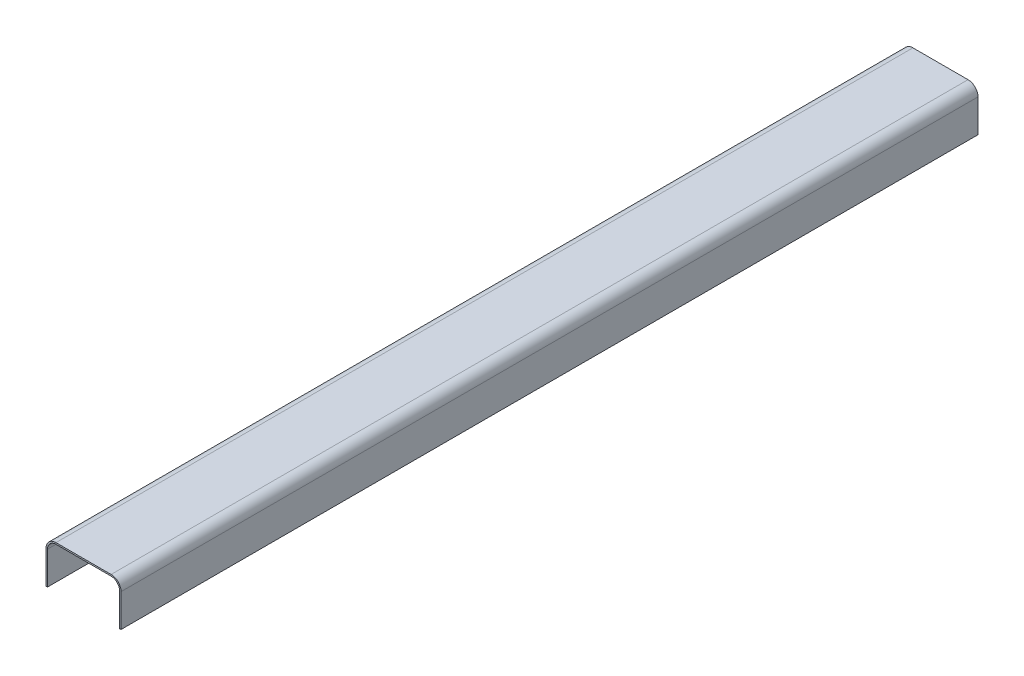
ISO-10303-21;
HEADER;
FILE_DESCRIPTION(('STEP AP214'),'2;1');
FILE_NAME('part.step','',(''),(''),'','','');
FILE_SCHEMA(('AUTOMOTIVE_DESIGN { 1 0 10303 214 1 1 1 1 }'));
ENDSEC;
DATA;
#1=APPLICATION_CONTEXT('core data for automotive mechanical design processes');
#2=APPLICATION_PROTOCOL_DEFINITION('international standard','automotive_design',2000,#1);
#3=PRODUCT_CONTEXT('',#1,'mechanical');
#4=PRODUCT('Part','Part','',(#3));
#5=PRODUCT_RELATED_PRODUCT_CATEGORY('part','',(#4));
#6=PRODUCT_DEFINITION_FORMATION('','',#4);
#7=PRODUCT_DEFINITION_CONTEXT('part definition',#1,'design');
#8=PRODUCT_DEFINITION('design','',#6,#7);
#9=PRODUCT_DEFINITION_SHAPE('','',#8);
#10=(LENGTH_UNIT() NAMED_UNIT(*) SI_UNIT(.MILLI.,.METRE.));
#11=(NAMED_UNIT(*) PLANE_ANGLE_UNIT() SI_UNIT($,.RADIAN.));
#12=(NAMED_UNIT(*) SI_UNIT($,.STERADIAN.) SOLID_ANGLE_UNIT());
#13=UNCERTAINTY_MEASURE_WITH_UNIT(LENGTH_MEASURE(1.E-05),#10,'distance_accuracy_value','');
#14=(GEOMETRIC_REPRESENTATION_CONTEXT(3) GLOBAL_UNCERTAINTY_ASSIGNED_CONTEXT((#13)) GLOBAL_UNIT_ASSIGNED_CONTEXT((#10,
#11,#12)) REPRESENTATION_CONTEXT('',''));
#15=CARTESIAN_POINT('',(0.,0.,0.));
#16=DIRECTION('',(0.,0.,1.));
#17=DIRECTION('',(1.,0.,0.));
#18=AXIS2_PLACEMENT_3D('',#15,#16,#17);
#19=CARTESIAN_POINT('',(0.,0.,1724.45));
#20=DIRECTION('',(0.,1.,0.));
#21=DIRECTION('',(0.,0.,1.));
#22=AXIS2_PLACEMENT_3D('',#19,#20,#21);
#23=PLANE('',#22);
#24=DIRECTION('',(0.,0.,-1.));
#25=VECTOR('',#24,1.);
#26=CARTESIAN_POINT('',(3.,0.,1724.45));
#27=LINE('',#26,#25);
#28=CARTESIAN_POINT('',(3.,0.,1724.45));
#29=VERTEX_POINT('',#28);
#30=CARTESIAN_POINT('',(3.,0.,0.));
#31=VERTEX_POINT('',#30);
#32=EDGE_CURVE('E127',#29,#31,#27,.T.);
#33=ORIENTED_EDGE('',*,*,#32,.F.);
#34=DIRECTION('',(1.,0.,0.));
#35=VECTOR('',#34,1.);
#36=CARTESIAN_POINT('',(0.,0.,1724.45));
#37=LINE('',#36,#35);
#38=CARTESIAN_POINT('',(0.,0.,1724.45));
#39=VERTEX_POINT('',#38);
#40=EDGE_CURVE('E140',#39,#29,#37,.T.);
#41=ORIENTED_EDGE('',*,*,#40,.F.);
#42=DIRECTION('',(0.,0.,-1.));
#43=VECTOR('',#42,1.);
#44=CARTESIAN_POINT('',(0.,0.,1724.45));
#45=LINE('',#44,#43);
#46=CARTESIAN_POINT('',(0.,0.,0.));
#47=VERTEX_POINT('',#46);
#48=EDGE_CURVE('E171',#39,#47,#45,.T.);
#49=ORIENTED_EDGE('',*,*,#48,.T.);
#50=DIRECTION('',(1.,0.,0.));
#51=VECTOR('',#50,1.);
#52=CARTESIAN_POINT('',(0.,0.,0.));
#53=LINE('',#52,#51);
#54=EDGE_CURVE('E143',#47,#31,#53,.T.);
#55=ORIENTED_EDGE('',*,*,#54,.T.);
#56=EDGE_LOOP('',(#33,#41,#49,#55));
#57=FACE_BOUND('',#56,.T.);
#58=ADVANCED_FACE('F34',(#57),#23,.F.);
#59=CARTESIAN_POINT('',(0.,0.,0.));
#60=DIRECTION('',(0.,0.,-1.));
#61=DIRECTION('',(-1.,0.,0.));
#62=AXIS2_PLACEMENT_3D('',#59,#60,#61);
#63=PLANE('',#62);
#64=CARTESIAN_POINT('',(20.,66.,0.));
#65=DIRECTION('',(0.,0.,-1.));
#66=DIRECTION('',(-1.,0.,0.));
#67=AXIS2_PLACEMENT_3D('',#64,#65,#66);
#68=CIRCLE('',#67,17.);
#69=CARTESIAN_POINT('',(3.,66.,0.));
#70=VERTEX_POINT('',#69);
#71=CARTESIAN_POINT('',(20.,83.,0.));
#72=VERTEX_POINT('',#71);
#73=EDGE_CURVE('E238',#70,#72,#68,.T.);
#74=ORIENTED_EDGE('',*,*,#73,.F.);
#75=DIRECTION('',(0.,-1.,0.));
#76=VECTOR('',#75,1.);
#77=CARTESIAN_POINT('',(3.,0.,0.));
#78=LINE('',#77,#76);
#79=EDGE_CURVE('E217',#70,#31,#78,.T.);
#80=ORIENTED_EDGE('',*,*,#79,.T.);
#81=ORIENTED_EDGE('',*,*,#54,.F.);
#82=DIRECTION('',(0.,-1.,0.));
#83=VECTOR('',#82,1.);
#84=CARTESIAN_POINT('',(0.,0.,0.));
#85=LINE('',#84,#83);
#86=CARTESIAN_POINT('',(0.,66.,0.));
#87=VERTEX_POINT('',#86);
#88=EDGE_CURVE('E160',#87,#47,#85,.T.);
#89=ORIENTED_EDGE('',*,*,#88,.F.);
#90=CARTESIAN_POINT('',(20.,66.,0.));
#91=DIRECTION('',(0.,0.,-1.));
#92=DIRECTION('',(-1.,0.,0.));
#93=AXIS2_PLACEMENT_3D('',#90,#91,#92);
#94=CIRCLE('',#93,20.);
#95=CARTESIAN_POINT('',(20.,86.,0.));
#96=VERTEX_POINT('',#95);
#97=EDGE_CURVE('E178',#87,#96,#94,.T.);
#98=ORIENTED_EDGE('',*,*,#97,.T.);
#99=DIRECTION('',(-1.,0.,0.));
#100=VECTOR('',#99,1.);
#101=CARTESIAN_POINT('',(0.,86.,0.));
#102=LINE('',#101,#100);
#103=CARTESIAN_POINT('',(131.,86.,0.));
#104=VERTEX_POINT('',#103);
#105=EDGE_CURVE('E166',#104,#96,#102,.T.);
#106=ORIENTED_EDGE('',*,*,#105,.F.);
#107=CARTESIAN_POINT('',(131.,66.,0.));
#108=DIRECTION('',(0.,0.,-1.));
#109=DIRECTION('',(-1.,0.,0.));
#110=AXIS2_PLACEMENT_3D('',#107,#108,#109);
#111=CIRCLE('',#110,20.);
#112=CARTESIAN_POINT('',(151.,66.,0.));
#113=VERTEX_POINT('',#112);
#114=EDGE_CURVE('E176',#104,#113,#111,.T.);
#115=ORIENTED_EDGE('',*,*,#114,.T.);
#116=DIRECTION('',(0.,1.,0.));
#117=VECTOR('',#116,1.);
#118=CARTESIAN_POINT('',(151.,0.,0.));
#119=LINE('',#118,#117);
#120=CARTESIAN_POINT('',(151.,0.,0.));
#121=VERTEX_POINT('',#120);
#122=EDGE_CURVE('E164',#121,#113,#119,.T.);
#123=ORIENTED_EDGE('',*,*,#122,.F.);
#124=CARTESIAN_POINT('',(148.,0.,0.));
#125=VERTEX_POINT('',#124);
#126=EDGE_CURVE('E162',#125,#121,#53,.T.);
#127=ORIENTED_EDGE('',*,*,#126,.F.);
#128=DIRECTION('',(0.,1.,0.));
#129=VECTOR('',#128,1.);
#130=CARTESIAN_POINT('',(148.,0.,0.));
#131=LINE('',#130,#129);
#132=CARTESIAN_POINT('',(148.,66.,0.));
#133=VERTEX_POINT('',#132);
#134=EDGE_CURVE('E214',#125,#133,#131,.T.);
#135=ORIENTED_EDGE('',*,*,#134,.T.);
#136=CARTESIAN_POINT('',(131.,66.,0.));
#137=DIRECTION('',(0.,0.,-1.));
#138=DIRECTION('',(-1.,0.,0.));
#139=AXIS2_PLACEMENT_3D('',#136,#137,#138);
#140=CIRCLE('',#139,17.);
#141=CARTESIAN_POINT('',(131.,83.,0.));
#142=VERTEX_POINT('',#141);
#143=EDGE_CURVE('E216',#142,#133,#140,.T.);
#144=ORIENTED_EDGE('',*,*,#143,.F.);
#145=DIRECTION('',(-1.,0.,0.));
#146=VECTOR('',#145,1.);
#147=CARTESIAN_POINT('',(0.,83.,0.));
#148=LINE('',#147,#146);
#149=EDGE_CURVE('E134',#142,#72,#148,.T.);
#150=ORIENTED_EDGE('',*,*,#149,.T.);
#151=EDGE_LOOP('',(#74,#80,#81,#89,#98,#106,#115,#123,#127,#135,#144,#150));
#152=FACE_BOUND('',#151,.T.);
#153=ADVANCED_FACE('F198',(#152),#63,.T.);
#154=CARTESIAN_POINT('',(0.,0.,1724.45));
#155=DIRECTION('',(1.,0.,0.));
#156=DIRECTION('',(0.,0.,-1.));
#157=AXIS2_PLACEMENT_3D('',#154,#155,#156);
#158=PLANE('',#157);
#159=DIRECTION('',(0.,-1.,0.));
#160=VECTOR('',#159,1.);
#161=CARTESIAN_POINT('',(0.,0.,1724.45));
#162=LINE('',#161,#160);
#163=CARTESIAN_POINT('',(0.,66.,1724.45));
#164=VERTEX_POINT('',#163);
#165=EDGE_CURVE('E148',#164,#39,#162,.T.);
#166=ORIENTED_EDGE('',*,*,#165,.F.);
#167=DIRECTION('',(0.,0.,-1.));
#168=VECTOR('',#167,1.);
#169=CARTESIAN_POINT('',(0.,66.,1724.45));
#170=LINE('',#169,#168);
#171=EDGE_CURVE('E173',#164,#87,#170,.T.);
#172=ORIENTED_EDGE('',*,*,#171,.T.);
#173=ORIENTED_EDGE('',*,*,#88,.T.);
#174=ORIENTED_EDGE('',*,*,#48,.F.);
#175=EDGE_LOOP('',(#166,#172,#173,#174));
#176=FACE_BOUND('',#175,.T.);
#177=ADVANCED_FACE('F192',(#176),#158,.F.);
#178=CARTESIAN_POINT('',(148.,0.,1724.45));
#179=VERTEX_POINT('',#178);
#180=CARTESIAN_POINT('',(151.,0.,1724.45));
#181=VERTEX_POINT('',#180);
#182=EDGE_CURVE('E150',#179,#181,#37,.T.);
#183=ORIENTED_EDGE('',*,*,#182,.F.);
#184=DIRECTION('',(0.,0.,-1.));
#185=VECTOR('',#184,1.);
#186=CARTESIAN_POINT('',(148.,0.,1724.45));
#187=LINE('',#186,#185);
#188=EDGE_CURVE('E144',#179,#125,#187,.T.);
#189=ORIENTED_EDGE('',*,*,#188,.T.);
#190=ORIENTED_EDGE('',*,*,#126,.T.);
#191=DIRECTION('',(0.,0.,-1.));
#192=VECTOR('',#191,1.);
#193=CARTESIAN_POINT('',(151.,0.,1724.45));
#194=LINE('',#193,#192);
#195=EDGE_CURVE('E159',#181,#121,#194,.T.);
#196=ORIENTED_EDGE('',*,*,#195,.F.);
#197=EDGE_LOOP('',(#183,#189,#190,#196));
#198=FACE_BOUND('',#197,.T.);
#199=ADVANCED_FACE('F210',(#198),#23,.F.);
#200=CARTESIAN_POINT('',(151.,0.,1724.45));
#201=DIRECTION('',(-1.,0.,0.));
#202=DIRECTION('',(0.,0.,1.));
#203=AXIS2_PLACEMENT_3D('',#200,#201,#202);
#204=PLANE('',#203);
#205=ORIENTED_EDGE('',*,*,#122,.T.);
#206=DIRECTION('',(0.,0.,-1.));
#207=VECTOR('',#206,1.);
#208=CARTESIAN_POINT('',(151.,66.,1724.45));
#209=LINE('',#208,#207);
#210=CARTESIAN_POINT('',(151.,66.,1724.45));
#211=VERTEX_POINT('',#210);
#212=EDGE_CURVE('E11',#113,#211,#209,.F.);
#213=ORIENTED_EDGE('',*,*,#212,.T.);
#214=DIRECTION('',(0.,1.,0.));
#215=VECTOR('',#214,1.);
#216=CARTESIAN_POINT('',(151.,0.,1724.45));
#217=LINE('',#216,#215);
#218=EDGE_CURVE('E149',#181,#211,#217,.T.);
#219=ORIENTED_EDGE('',*,*,#218,.F.);
#220=ORIENTED_EDGE('',*,*,#195,.T.);
#221=EDGE_LOOP('',(#205,#213,#219,#220));
#222=FACE_BOUND('',#221,.T.);
#223=ADVANCED_FACE('F206',(#222),#204,.F.);
#224=CARTESIAN_POINT('',(0.,86.,1724.45));
#225=DIRECTION('',(0.,-1.,0.));
#226=DIRECTION('',(0.,0.,-1.));
#227=AXIS2_PLACEMENT_3D('',#224,#225,#226);
#228=PLANE('',#227);
#229=ORIENTED_EDGE('',*,*,#105,.T.);
#230=DIRECTION('',(0.,0.,-1.));
#231=VECTOR('',#230,1.);
#232=CARTESIAN_POINT('',(20.,86.,1724.45));
#233=LINE('',#232,#231);
#234=CARTESIAN_POINT('',(20.,86.,1724.45));
#235=VERTEX_POINT('',#234);
#236=EDGE_CURVE('E183',#96,#235,#233,.F.);
#237=ORIENTED_EDGE('',*,*,#236,.T.);
#238=DIRECTION('',(-1.,0.,0.));
#239=VECTOR('',#238,1.);
#240=CARTESIAN_POINT('',(0.,86.,1724.45));
#241=LINE('',#240,#239);
#242=CARTESIAN_POINT('',(131.,86.,1724.45));
#243=VERTEX_POINT('',#242);
#244=EDGE_CURVE('E152',#243,#235,#241,.T.);
#245=ORIENTED_EDGE('',*,*,#244,.F.);
#246=DIRECTION('',(0.,0.,-1.));
#247=VECTOR('',#246,1.);
#248=CARTESIAN_POINT('',(131.,86.,1724.45));
#249=LINE('',#248,#247);
#250=EDGE_CURVE('E180',#243,#104,#249,.T.);
#251=ORIENTED_EDGE('',*,*,#250,.T.);
#252=EDGE_LOOP('',(#229,#237,#245,#251));
#253=FACE_BOUND('',#252,.T.);
#254=ADVANCED_FACE('F200',(#253),#228,.F.);
#255=CARTESIAN_POINT('',(0.,0.,1724.45));
#256=DIRECTION('',(0.,0.,-1.));
#257=DIRECTION('',(-1.,0.,0.));
#258=AXIS2_PLACEMENT_3D('',#255,#256,#257);
#259=PLANE('',#258);
#260=DIRECTION('',(0.,-1.,0.));
#261=VECTOR('',#260,1.);
#262=CARTESIAN_POINT('',(3.,0.,1724.45));
#263=LINE('',#262,#261);
#264=CARTESIAN_POINT('',(3.,66.,1724.45));
#265=VERTEX_POINT('',#264);
#266=EDGE_CURVE('E123',#265,#29,#263,.T.);
#267=ORIENTED_EDGE('',*,*,#266,.F.);
#268=CARTESIAN_POINT('',(20.,66.,1724.45));
#269=DIRECTION('',(0.,0.,-1.));
#270=DIRECTION('',(-1.,0.,0.));
#271=AXIS2_PLACEMENT_3D('',#268,#269,#270);
#272=CIRCLE('',#271,17.);
#273=CARTESIAN_POINT('',(20.,83.,1724.45));
#274=VERTEX_POINT('',#273);
#275=EDGE_CURVE('E228',#274,#265,#272,.F.);
#276=ORIENTED_EDGE('',*,*,#275,.F.);
#277=DIRECTION('',(-1.,0.,0.));
#278=VECTOR('',#277,1.);
#279=CARTESIAN_POINT('',(0.,83.,1724.45));
#280=LINE('',#279,#278);
#281=CARTESIAN_POINT('',(131.,83.,1724.45));
#282=VERTEX_POINT('',#281);
#283=EDGE_CURVE('E224',#282,#274,#280,.T.);
#284=ORIENTED_EDGE('',*,*,#283,.F.);
#285=CARTESIAN_POINT('',(131.,66.,1724.45));
#286=DIRECTION('',(0.,0.,-1.));
#287=DIRECTION('',(-1.,0.,0.));
#288=AXIS2_PLACEMENT_3D('',#285,#286,#287);
#289=CIRCLE('',#288,17.);
#290=CARTESIAN_POINT('',(148.,66.,1724.45));
#291=VERTEX_POINT('',#290);
#292=EDGE_CURVE('E226',#291,#282,#289,.F.);
#293=ORIENTED_EDGE('',*,*,#292,.F.);
#294=DIRECTION('',(0.,1.,0.));
#295=VECTOR('',#294,1.);
#296=CARTESIAN_POINT('',(148.,0.,1724.45));
#297=LINE('',#296,#295);
#298=EDGE_CURVE('E133',#179,#291,#297,.T.);
#299=ORIENTED_EDGE('',*,*,#298,.F.);
#300=ORIENTED_EDGE('',*,*,#182,.T.);
#301=ORIENTED_EDGE('',*,*,#218,.T.);
#302=CARTESIAN_POINT('',(131.,66.,1724.45));
#303=DIRECTION('',(0.,0.,-1.));
#304=DIRECTION('',(-1.,0.,0.));
#305=AXIS2_PLACEMENT_3D('',#302,#303,#304);
#306=CIRCLE('',#305,20.);
#307=EDGE_CURVE('E185',#211,#243,#306,.F.);
#308=ORIENTED_EDGE('',*,*,#307,.T.);
#309=ORIENTED_EDGE('',*,*,#244,.T.);
#310=CARTESIAN_POINT('',(20.,66.,1724.45));
#311=DIRECTION('',(0.,0.,-1.));
#312=DIRECTION('',(-1.,0.,0.));
#313=AXIS2_PLACEMENT_3D('',#310,#311,#312);
#314=CIRCLE('',#313,20.);
#315=EDGE_CURVE('E42',#235,#164,#314,.F.);
#316=ORIENTED_EDGE('',*,*,#315,.T.);
#317=ORIENTED_EDGE('',*,*,#165,.T.);
#318=ORIENTED_EDGE('',*,*,#40,.T.);
#319=EDGE_LOOP('',(#267,#276,#284,#293,#299,#300,#301,#308,#309,#316,#317,#318));
#320=FACE_BOUND('',#319,.T.);
#321=ADVANCED_FACE('F146',(#320),#259,.F.);
#322=CARTESIAN_POINT('',(20.,66.,1724.45));
#323=DIRECTION('',(0.,0.,-1.));
#324=DIRECTION('',(-1.,0.,0.));
#325=AXIS2_PLACEMENT_3D('',#322,#323,#324);
#326=CYLINDRICAL_SURFACE('',#325,20.);
#327=ORIENTED_EDGE('',*,*,#315,.F.);
#328=ORIENTED_EDGE('',*,*,#236,.F.);
#329=ORIENTED_EDGE('',*,*,#97,.F.);
#330=ORIENTED_EDGE('',*,*,#171,.F.);
#331=EDGE_LOOP('',(#327,#328,#329,#330));
#332=FACE_BOUND('',#331,.T.);
#333=ADVANCED_FACE('F194',(#332),#326,.T.);
#334=CARTESIAN_POINT('',(131.,66.,1724.45));
#335=DIRECTION('',(0.,0.,-1.));
#336=DIRECTION('',(-1.,0.,0.));
#337=AXIS2_PLACEMENT_3D('',#334,#335,#336);
#338=CYLINDRICAL_SURFACE('',#337,20.);
#339=ORIENTED_EDGE('',*,*,#307,.F.);
#340=ORIENTED_EDGE('',*,*,#212,.F.);
#341=ORIENTED_EDGE('',*,*,#114,.F.);
#342=ORIENTED_EDGE('',*,*,#250,.F.);
#343=EDGE_LOOP('',(#339,#340,#341,#342));
#344=FACE_BOUND('',#343,.T.);
#345=ADVANCED_FACE('F36',(#344),#338,.T.);
#346=CARTESIAN_POINT('',(3.,0.,1724.45));
#347=DIRECTION('',(1.,0.,0.));
#348=DIRECTION('',(0.,0.,-1.));
#349=AXIS2_PLACEMENT_3D('',#346,#347,#348);
#350=PLANE('',#349);
#351=ORIENTED_EDGE('',*,*,#266,.T.);
#352=ORIENTED_EDGE('',*,*,#32,.T.);
#353=ORIENTED_EDGE('',*,*,#79,.F.);
#354=DIRECTION('',(0.,0.,-1.));
#355=VECTOR('',#354,1.);
#356=CARTESIAN_POINT('',(3.,66.,1724.45));
#357=LINE('',#356,#355);
#358=EDGE_CURVE('E129',#265,#70,#357,.T.);
#359=ORIENTED_EDGE('',*,*,#358,.F.);
#360=EDGE_LOOP('',(#351,#352,#353,#359));
#361=FACE_BOUND('',#360,.T.);
#362=ADVANCED_FACE('F125',(#361),#350,.T.);
#363=CARTESIAN_POINT('',(148.,0.,1724.45));
#364=DIRECTION('',(-1.,0.,0.));
#365=DIRECTION('',(0.,0.,1.));
#366=AXIS2_PLACEMENT_3D('',#363,#364,#365);
#367=PLANE('',#366);
#368=ORIENTED_EDGE('',*,*,#134,.F.);
#369=ORIENTED_EDGE('',*,*,#188,.F.);
#370=ORIENTED_EDGE('',*,*,#298,.T.);
#371=DIRECTION('',(0.,0.,1.));
#372=VECTOR('',#371,1.);
#373=CARTESIAN_POINT('',(148.,66.,1724.45));
#374=LINE('',#373,#372);
#375=EDGE_CURVE('E49',#133,#291,#374,.T.);
#376=ORIENTED_EDGE('',*,*,#375,.F.);
#377=EDGE_LOOP('',(#368,#369,#370,#376));
#378=FACE_BOUND('',#377,.T.);
#379=ADVANCED_FACE('F312',(#378),#367,.T.);
#380=CARTESIAN_POINT('',(0.,83.,1724.45));
#381=DIRECTION('',(0.,-1.,0.));
#382=DIRECTION('',(0.,0.,-1.));
#383=AXIS2_PLACEMENT_3D('',#380,#381,#382);
#384=PLANE('',#383);
#385=ORIENTED_EDGE('',*,*,#149,.F.);
#386=DIRECTION('',(0.,0.,-1.));
#387=VECTOR('',#386,1.);
#388=CARTESIAN_POINT('',(131.,83.,1724.45));
#389=LINE('',#388,#387);
#390=EDGE_CURVE('E235',#282,#142,#389,.T.);
#391=ORIENTED_EDGE('',*,*,#390,.F.);
#392=ORIENTED_EDGE('',*,*,#283,.T.);
#393=DIRECTION('',(0.,0.,-1.));
#394=VECTOR('',#393,1.);
#395=CARTESIAN_POINT('',(20.,83.,1724.45));
#396=LINE('',#395,#394);
#397=EDGE_CURVE('E229',#72,#274,#396,.F.);
#398=ORIENTED_EDGE('',*,*,#397,.F.);
#399=EDGE_LOOP('',(#385,#391,#392,#398));
#400=FACE_BOUND('',#399,.T.);
#401=ADVANCED_FACE('F246',(#400),#384,.T.);
#402=CARTESIAN_POINT('',(20.,66.,1724.45));
#403=DIRECTION('',(0.,0.,-1.));
#404=DIRECTION('',(-1.,0.,0.));
#405=AXIS2_PLACEMENT_3D('',#402,#403,#404);
#406=CYLINDRICAL_SURFACE('',#405,17.);
#407=ORIENTED_EDGE('',*,*,#275,.T.);
#408=ORIENTED_EDGE('',*,*,#358,.T.);
#409=ORIENTED_EDGE('',*,*,#73,.T.);
#410=ORIENTED_EDGE('',*,*,#397,.T.);
#411=EDGE_LOOP('',(#407,#408,#409,#410));
#412=FACE_BOUND('',#411,.T.);
#413=ADVANCED_FACE('F241',(#412),#406,.F.);
#414=CARTESIAN_POINT('',(131.,66.,1724.45));
#415=DIRECTION('',(0.,0.,-1.));
#416=DIRECTION('',(-1.,0.,0.));
#417=AXIS2_PLACEMENT_3D('',#414,#415,#416);
#418=CYLINDRICAL_SURFACE('',#417,17.);
#419=ORIENTED_EDGE('',*,*,#292,.T.);
#420=ORIENTED_EDGE('',*,*,#390,.T.);
#421=ORIENTED_EDGE('',*,*,#143,.T.);
#422=ORIENTED_EDGE('',*,*,#375,.T.);
#423=EDGE_LOOP('',(#419,#420,#421,#422));
#424=FACE_BOUND('',#423,.T.);
#425=ADVANCED_FACE('F249',(#424),#418,.F.);
#426=CLOSED_SHELL('',(#58,#153,#177,#199,#223,#254,#321,#333,#345,#362,#379,#401,#413,#425));
#427=MANIFOLD_SOLID_BREP('B2',#426);
#428=ADVANCED_BREP_SHAPE_REPRESENTATION('',(#18,#427),#14);
#429=SHAPE_DEFINITION_REPRESENTATION(#9,#428);
ENDSEC;
END-ISO-10303-21;
